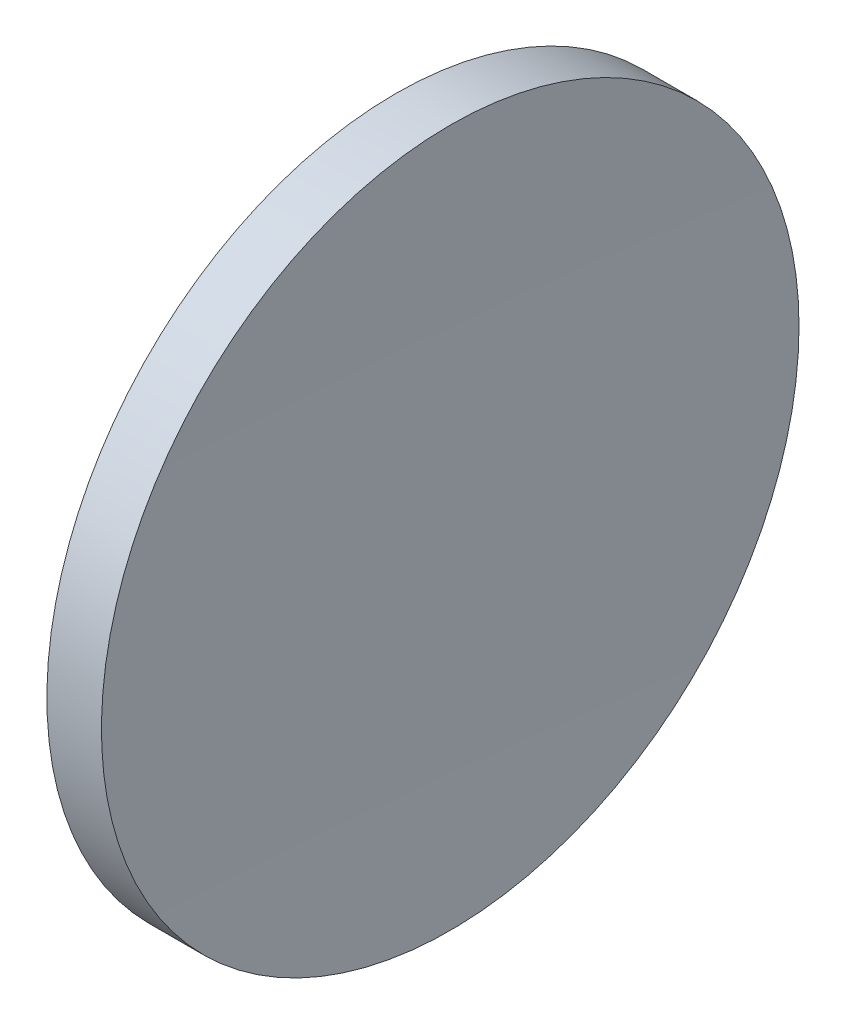
ISO-10303-21;
HEADER;
FILE_DESCRIPTION(('STEP AP214'),'2;1');
FILE_NAME('part.step','',(''),(''),'','','');
FILE_SCHEMA(('AUTOMOTIVE_DESIGN { 1 0 10303 214 1 1 1 1 }'));
ENDSEC;
DATA;
#1=APPLICATION_CONTEXT('core data for automotive mechanical design processes');
#2=APPLICATION_PROTOCOL_DEFINITION('international standard','automotive_design',2000,#1);
#3=PRODUCT_CONTEXT('',#1,'mechanical');
#4=PRODUCT('Part','Part','',(#3));
#5=PRODUCT_RELATED_PRODUCT_CATEGORY('part','',(#4));
#6=PRODUCT_DEFINITION_FORMATION('','',#4);
#7=PRODUCT_DEFINITION_CONTEXT('part definition',#1,'design');
#8=PRODUCT_DEFINITION('design','',#6,#7);
#9=PRODUCT_DEFINITION_SHAPE('','',#8);
#10=(LENGTH_UNIT() NAMED_UNIT(*) SI_UNIT(.MILLI.,.METRE.));
#11=(NAMED_UNIT(*) PLANE_ANGLE_UNIT() SI_UNIT($,.RADIAN.));
#12=(NAMED_UNIT(*) SI_UNIT($,.STERADIAN.) SOLID_ANGLE_UNIT());
#13=UNCERTAINTY_MEASURE_WITH_UNIT(LENGTH_MEASURE(1.E-05),#10,'distance_accuracy_value','');
#14=(GEOMETRIC_REPRESENTATION_CONTEXT(3) GLOBAL_UNCERTAINTY_ASSIGNED_CONTEXT((#13)) GLOBAL_UNIT_ASSIGNED_CONTEXT((#10,
#11,#12)) REPRESENTATION_CONTEXT('',''));
#15=CARTESIAN_POINT('',(0.,0.,0.));
#16=DIRECTION('',(0.,0.,1.));
#17=DIRECTION('',(1.,0.,0.));
#18=AXIS2_PLACEMENT_3D('',#15,#16,#17);
#19=CARTESIAN_POINT('',(436.645520155767,34.5168962409161,22.1552279145953));
#20=DIRECTION('',(1.,0.,0.));
#21=DIRECTION('',(0.,1.,0.));
#22=AXIS2_PLACEMENT_3D('',#19,#20,#21);
#23=SPHERICAL_SURFACE('',#22,523.9);
#24=CARTESIAN_POINT('',(-87.1005251753652,34.5168962409161,22.1552279145953));
#25=DIRECTION('',(1.,0.,0.));
#26=DIRECTION('',(0.,0.,-1.));
#27=AXIS2_PLACEMENT_3D('',#24,#25,#26);
#28=CIRCLE('',#27,12.7);
#29=CARTESIAN_POINT('',(-87.1005251753652,34.5168962409161,9.45522791459534));
#30=VERTEX_POINT('',#29);
#31=EDGE_CURVE('E8',#30,#30,#28,.T.);
#32=ORIENTED_EDGE('',*,*,#31,.T.);
#33=EDGE_LOOP('',(#32));
#34=FACE_BOUND('',#33,.T.);
#35=ADVANCED_FACE('F13',(#34),#23,.F.);
#36=CARTESIAN_POINT('',(-87.2544798442333,34.5168962409161,22.1552279145953));
#37=DIRECTION('',(1.,0.,0.));
#38=DIRECTION('',(0.,0.,-1.));
#39=AXIS2_PLACEMENT_3D('',#36,#37,#38);
#40=CYLINDRICAL_SURFACE('',#39,12.7);
#41=CARTESIAN_POINT('',(-89.0874233324195,34.5168962409161,22.1552279145953));
#42=DIRECTION('',(1.,0.,0.));
#43=DIRECTION('',(0.,0.,-1.));
#44=AXIS2_PLACEMENT_3D('',#41,#42,#43);
#45=CIRCLE('',#44,12.7);
#46=CARTESIAN_POINT('',(-89.0874233324195,34.5168962409161,9.45522791459531));
#47=VERTEX_POINT('',#46);
#48=EDGE_CURVE('E19',#47,#47,#45,.T.);
#49=ORIENTED_EDGE('',*,*,#48,.T.);
#50=EDGE_LOOP('',(#49));
#51=FACE_BOUND('',#50,.T.);
#52=ORIENTED_EDGE('',*,*,#31,.F.);
#53=EDGE_LOOP('',(#52));
#54=FACE_BOUND('',#53,.T.);
#55=ADVANCED_FACE('F25',(#51,#54),#40,.T.);
#56=CARTESIAN_POINT('',(83.3455201557667,34.5168962409161,22.1552279145953));
#57=DIRECTION('',(1.,0.,0.));
#58=DIRECTION('',(0.,1.,0.));
#59=AXIS2_PLACEMENT_3D('',#56,#57,#58);
#60=SPHERICAL_SURFACE('',#59,172.9);
#61=ORIENTED_EDGE('',*,*,#48,.F.);
#62=EDGE_LOOP('',(#61));
#63=FACE_BOUND('',#62,.T.);
#64=ADVANCED_FACE('F28',(#63),#60,.T.);
#65=CLOSED_SHELL('',(#35,#55,#64));
#66=MANIFOLD_SOLID_BREP('B1',#65);
#67=ADVANCED_BREP_SHAPE_REPRESENTATION('',(#18,#66),#14);
#68=SHAPE_DEFINITION_REPRESENTATION(#9,#67);
ENDSEC;
END-ISO-10303-21;
